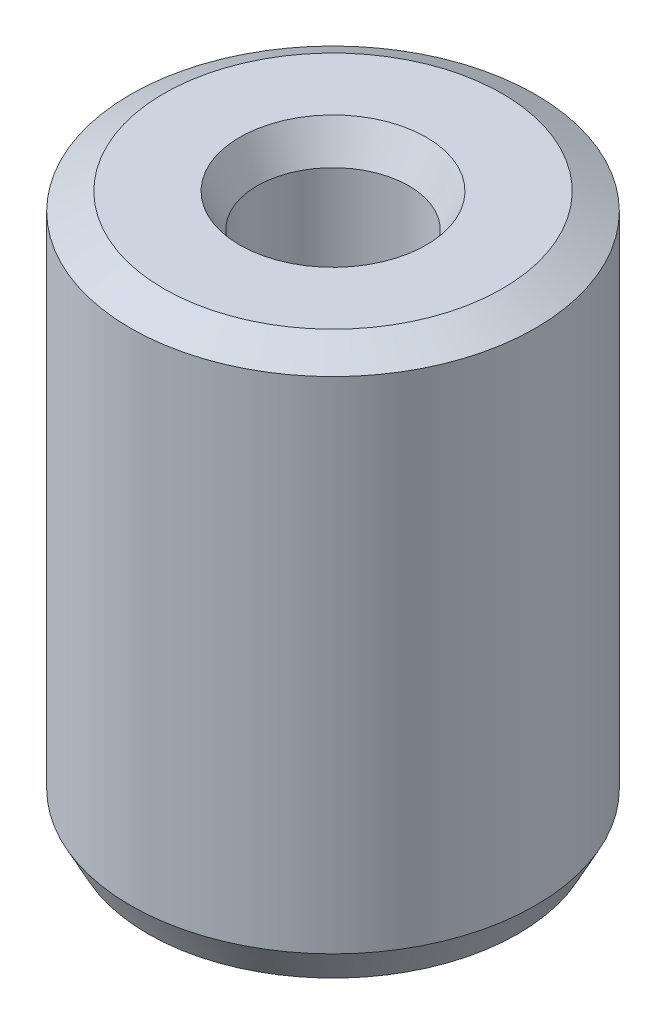
ISO-10303-21;
HEADER;
FILE_DESCRIPTION(('STEP AP214'),'2;1');
FILE_NAME('part.step','',(''),(''),'','','');
FILE_SCHEMA(('AUTOMOTIVE_DESIGN { 1 0 10303 214 1 1 1 1 }'));
ENDSEC;
DATA;
#1=APPLICATION_CONTEXT('core data for automotive mechanical design processes');
#2=APPLICATION_PROTOCOL_DEFINITION('international standard','automotive_design',2000,#1);
#3=PRODUCT_CONTEXT('',#1,'mechanical');
#4=PRODUCT('Part','Part','',(#3));
#5=PRODUCT_RELATED_PRODUCT_CATEGORY('part','',(#4));
#6=PRODUCT_DEFINITION_FORMATION('','',#4);
#7=PRODUCT_DEFINITION_CONTEXT('part definition',#1,'design');
#8=PRODUCT_DEFINITION('design','',#6,#7);
#9=PRODUCT_DEFINITION_SHAPE('','',#8);
#10=(LENGTH_UNIT() NAMED_UNIT(*) SI_UNIT(.MILLI.,.METRE.));
#11=(NAMED_UNIT(*) PLANE_ANGLE_UNIT() SI_UNIT($,.RADIAN.));
#12=(NAMED_UNIT(*) SI_UNIT($,.STERADIAN.) SOLID_ANGLE_UNIT());
#13=UNCERTAINTY_MEASURE_WITH_UNIT(LENGTH_MEASURE(1.E-05),#10,'distance_accuracy_value','');
#14=(GEOMETRIC_REPRESENTATION_CONTEXT(3) GLOBAL_UNCERTAINTY_ASSIGNED_CONTEXT((#13)) GLOBAL_UNIT_ASSIGNED_CONTEXT((#10,
#11,#12)) REPRESENTATION_CONTEXT('',''));
#15=CARTESIAN_POINT('',(0.,0.,0.));
#16=DIRECTION('',(0.,0.,1.));
#17=DIRECTION('',(1.,0.,0.));
#18=AXIS2_PLACEMENT_3D('',#15,#16,#17);
#19=CARTESIAN_POINT('',(0.,61.2046065079372,0.));
#20=DIRECTION('',(0.,-1.,0.));
#21=DIRECTION('',(0.,0.,-1.));
#22=AXIS2_PLACEMENT_3D('',#19,#20,#21);
#23=CYLINDRICAL_SURFACE('',#22,22.5);
#24=CARTESIAN_POINT('',(0.,3.70337874984975,0.));
#25=DIRECTION('',(0.,1.,0.));
#26=DIRECTION('',(0.,0.,1.));
#27=AXIS2_PLACEMENT_3D('',#24,#25,#26);
#28=CIRCLE('',#27,22.5);
#29=CARTESIAN_POINT('',(0.,3.70337874984975,22.5));
#30=VERTEX_POINT('',#29);
#31=EDGE_CURVE('E10',#30,#30,#28,.T.);
#32=ORIENTED_EDGE('',*,*,#31,.T.);
#33=EDGE_LOOP('',(#32));
#34=FACE_BOUND('',#33,.T.);
#35=CARTESIAN_POINT('',(0.,59.262396679795,0.));
#36=DIRECTION('',(0.,1.,0.));
#37=DIRECTION('',(0.,0.,1.));
#38=AXIS2_PLACEMENT_3D('',#35,#36,#37);
#39=CIRCLE('',#38,22.5);
#40=CARTESIAN_POINT('',(0.,59.262396679795,22.5));
#41=VERTEX_POINT('',#40);
#42=EDGE_CURVE('E50',#41,#41,#39,.F.);
#43=ORIENTED_EDGE('',*,*,#42,.T.);
#44=EDGE_LOOP('',(#43));
#45=FACE_BOUND('',#44,.T.);
#46=ADVANCED_FACE('F39',(#34,#45),#23,.T.);
#47=CARTESIAN_POINT('',(0.,61.2046065079372,0.));
#48=DIRECTION('',(0.,1.,0.));
#49=DIRECTION('',(0.,0.,1.));
#50=AXIS2_PLACEMENT_3D('',#47,#48,#49);
#51=PLANE('',#50);
#52=CARTESIAN_POINT('',(0.,61.2046065079372,0.));
#53=DIRECTION('',(0.,1.,0.));
#54=DIRECTION('',(0.,0.,1.));
#55=AXIS2_PLACEMENT_3D('',#52,#53,#54);
#56=CIRCLE('',#55,10.3734735527176);
#57=CARTESIAN_POINT('',(0.,61.2046065079372,10.3734735527176));
#58=VERTEX_POINT('',#57);
#59=EDGE_CURVE('E58',#58,#58,#56,.F.);
#60=ORIENTED_EDGE('',*,*,#59,.T.);
#61=EDGE_LOOP('',(#60));
#62=FACE_BOUND('',#61,.T.);
#63=CARTESIAN_POINT('',(0.,61.2046065079372,0.));
#64=DIRECTION('',(0.,1.,0.));
#65=DIRECTION('',(0.,0.,1.));
#66=AXIS2_PLACEMENT_3D('',#63,#64,#65);
#67=CIRCLE('',#66,18.7966212501502);
#68=CARTESIAN_POINT('',(0.,61.2046065079372,18.7966212501502));
#69=VERTEX_POINT('',#68);
#70=EDGE_CURVE('E61',#69,#69,#67,.T.);
#71=ORIENTED_EDGE('',*,*,#70,.T.);
#72=EDGE_LOOP('',(#71));
#73=FACE_BOUND('',#72,.T.);
#74=ADVANCED_FACE('F88',(#62,#73),#51,.T.);
#75=CARTESIAN_POINT('',(0.,0.,0.));
#76=DIRECTION('',(0.,1.,0.));
#77=DIRECTION('',(0.,0.,1.));
#78=AXIS2_PLACEMENT_3D('',#75,#76,#77);
#79=PLANE('',#78);
#80=CARTESIAN_POINT('',(0.,0.,0.));
#81=DIRECTION('',(0.,1.,0.));
#82=DIRECTION('',(0.,0.,1.));
#83=AXIS2_PLACEMENT_3D('',#80,#81,#82);
#84=CIRCLE('',#83,12.1346424744253);
#85=CARTESIAN_POINT('',(0.,0.,-12.1346424744253));
#86=VERTEX_POINT('',#85);
#87=EDGE_CURVE('E51',#86,#86,#84,.T.);
#88=ORIENTED_EDGE('',*,*,#87,.T.);
#89=EDGE_LOOP('',(#88));
#90=FACE_BOUND('',#89,.T.);
#91=CARTESIAN_POINT('',(0.,0.,0.));
#92=DIRECTION('',(0.,1.,0.));
#93=DIRECTION('',(0.,0.,1.));
#94=AXIS2_PLACEMENT_3D('',#91,#92,#93);
#95=CIRCLE('',#94,20.5577901718579);
#96=CARTESIAN_POINT('',(0.,0.,20.5577901718579));
#97=VERTEX_POINT('',#96);
#98=EDGE_CURVE('E54',#97,#97,#95,.F.);
#99=ORIENTED_EDGE('',*,*,#98,.T.);
#100=EDGE_LOOP('',(#99));
#101=FACE_BOUND('',#100,.T.);
#102=ADVANCED_FACE('F83',(#90,#101),#79,.F.);
#103=CARTESIAN_POINT('',(0.,61.2046065079372,0.));
#104=DIRECTION('',(0.,-1.,0.));
#105=DIRECTION('',(0.,0.,-1.));
#106=AXIS2_PLACEMENT_3D('',#103,#104,#105);
#107=CYLINDRICAL_SURFACE('',#106,8.43126372457545);
#108=CARTESIAN_POINT('',(0.,57.5012277580874,0.));
#109=DIRECTION('',(0.,1.,0.));
#110=DIRECTION('',(0.,0.,1.));
#111=AXIS2_PLACEMENT_3D('',#108,#109,#110);
#112=CIRCLE('',#111,8.43126372457545);
#113=CARTESIAN_POINT('',(0.,57.5012277580874,8.43126372457545));
#114=VERTEX_POINT('',#113);
#115=EDGE_CURVE('E67',#114,#114,#112,.T.);
#116=ORIENTED_EDGE('',*,*,#115,.T.);
#117=EDGE_LOOP('',(#116));
#118=FACE_BOUND('',#117,.T.);
#119=CARTESIAN_POINT('',(0.,1.94220982814217,0.));
#120=DIRECTION('',(0.,1.,0.));
#121=DIRECTION('',(0.,0.,1.));
#122=AXIS2_PLACEMENT_3D('',#119,#120,#121);
#123=CIRCLE('',#122,8.43126372457545);
#124=CARTESIAN_POINT('',(0.,1.94220982814217,-8.43126372457545));
#125=VERTEX_POINT('',#124);
#126=EDGE_CURVE('E69',#125,#125,#123,.F.);
#127=ORIENTED_EDGE('',*,*,#126,.T.);
#128=EDGE_LOOP('',(#127));
#129=FACE_BOUND('',#128,.T.);
#130=ADVANCED_FACE('F71',(#118,#129),#107,.F.);
#131=CARTESIAN_POINT('',(0.,57.5012277580874,0.));
#132=DIRECTION('',(0.,1.,0.));
#133=DIRECTION('',(0.,0.,1.));
#134=AXIS2_PLACEMENT_3D('',#131,#132,#133);
#135=CONICAL_SURFACE('',#134,8.43126372457545,0.483009991532542);
#136=ORIENTED_EDGE('',*,*,#59,.F.);
#137=EDGE_LOOP('',(#136));
#138=FACE_BOUND('',#137,.T.);
#139=ORIENTED_EDGE('',*,*,#115,.F.);
#140=EDGE_LOOP('',(#139));
#141=FACE_BOUND('',#140,.T.);
#142=ADVANCED_FACE('F77',(#138,#141),#135,.F.);
#143=CARTESIAN_POINT('',(0.,0.,0.));
#144=DIRECTION('',(0.,-1.,0.));
#145=DIRECTION('',(0.,0.,-1.));
#146=AXIS2_PLACEMENT_3D('',#143,#144,#145);
#147=CONICAL_SURFACE('',#146,12.1346424744253,1.08778633526236);
#148=CARTESIAN_POINT('',(0.,1.94220982814217,-8.43126372457545));
#149=CARTESIAN_POINT('',(0.,1.92197847576569,-8.46984058655305));
#150=CARTESIAN_POINT('',(0.,1.9017471233892,-8.50841744853065));
#151=CARTESIAN_POINT('',(0.,1.86128441863624,-8.58557117248585));
#152=CARTESIAN_POINT('',(0.,1.84105306625976,-8.62414803446346));
#153=CARTESIAN_POINT('',(0.,1.8005903615068,-8.70130175841866));
#154=CARTESIAN_POINT('',(0.,1.78035900913032,-8.73987862039626));
#155=CARTESIAN_POINT('',(0.,1.73989630437736,-8.81703234435147));
#156=CARTESIAN_POINT('',(0.,1.71966495200088,-8.85560920632907));
#157=CARTESIAN_POINT('',(0.,1.67920224724791,-8.93276293028427));
#158=CARTESIAN_POINT('',(0.,1.65897089487143,-8.97133979226188));
#159=CARTESIAN_POINT('',(0.,1.61850819011847,-9.04849351621708));
#160=CARTESIAN_POINT('',(0.,1.59827683774199,-9.08707037819468));
#161=CARTESIAN_POINT('',(0.,1.55781413298903,-9.16422410214989));
#162=CARTESIAN_POINT('',(0.,1.53758278061255,-9.20280096412749));
#163=CARTESIAN_POINT('',(0.,1.49712007585959,-9.27995468808269));
#164=CARTESIAN_POINT('',(0.,1.47688872348311,-9.3185315500603));
#165=CARTESIAN_POINT('',(0.,1.43642601873014,-9.3956852740155));
#166=CARTESIAN_POINT('',(0.,1.41619466635366,-9.4342621359931));
#167=CARTESIAN_POINT('',(0.,1.3757319616007,-9.51141585994831));
#168=CARTESIAN_POINT('',(0.,1.35550060922422,-9.54999272192591));
#169=CARTESIAN_POINT('',(0.,1.31503790447126,-9.62714644588111));
#170=CARTESIAN_POINT('',(0.,1.29480655209478,-9.66572330785871));
#171=CARTESIAN_POINT('',(0.,1.25434384734182,-9.74287703181392));
#172=CARTESIAN_POINT('',(0.,1.23411249496533,-9.78145389379152));
#173=CARTESIAN_POINT('',(0.,1.19364979021237,-9.85860761774673));
#174=CARTESIAN_POINT('',(0.,1.17341843783589,-9.89718447972433));
#175=CARTESIAN_POINT('',(0.,1.13295573308293,-9.97433820367953));
#176=CARTESIAN_POINT('',(0.,1.11272438070645,-10.0129150656571));
#177=CARTESIAN_POINT('',(0.,1.07226167595349,-10.0900687896123));
#178=CARTESIAN_POINT('',(0.,1.05203032357701,-10.1286456515899));
#179=CARTESIAN_POINT('',(0.,1.01156761882404,-10.2057993755451));
#180=CARTESIAN_POINT('',(0.,0.991336266447564,-10.2443762375227));
#181=CARTESIAN_POINT('',(0.,0.950873561694602,-10.3215299614779));
#182=CARTESIAN_POINT('',(0.,0.930642209318121,-10.3601068234556));
#183=CARTESIAN_POINT('',(0.,0.89017950456516,-10.4372605474108));
#184=CARTESIAN_POINT('',(0.,0.869948152188678,-10.4758374093884));
#185=CARTESIAN_POINT('',(0.,0.829485447435717,-10.5529911333436));
#186=CARTESIAN_POINT('',(0.,0.809254095059236,-10.5915679953212));
#187=CARTESIAN_POINT('',(0.,0.768791390306274,-10.6687217192764));
#188=CARTESIAN_POINT('',(0.,0.748560037929793,-10.707298581254));
#189=CARTESIAN_POINT('',(0.,0.708097333176831,-10.7844523052092));
#190=CARTESIAN_POINT('',(0.,0.687865980800351,-10.8230291671868));
#191=CARTESIAN_POINT('',(0.,0.647403276047389,-10.900182891142));
#192=CARTESIAN_POINT('',(0.,0.627171923670908,-10.9387597531196));
#193=CARTESIAN_POINT('',(0.,0.586709218917946,-11.0159134770748));
#194=CARTESIAN_POINT('',(0.,0.566477866541465,-11.0544903390524));
#195=CARTESIAN_POINT('',(0.,0.526015161788503,-11.1316440630076));
#196=CARTESIAN_POINT('',(0.,0.505783809412023,-11.1702209249852));
#197=CARTESIAN_POINT('',(0.,0.465321104659061,-11.2473746489404));
#198=CARTESIAN_POINT('',(0.,0.44508975228258,-11.285951510918));
#199=CARTESIAN_POINT('',(0.,0.404627047529618,-11.3631052348732));
#200=CARTESIAN_POINT('',(0.,0.384395695153137,-11.4016820968508));
#201=CARTESIAN_POINT('',(0.,0.343932990400175,-11.478835820806));
#202=CARTESIAN_POINT('',(0.,0.323701638023694,-11.5174126827836));
#203=CARTESIAN_POINT('',(0.,0.283238933270732,-11.5945664067388));
#204=CARTESIAN_POINT('',(0.,0.263007580894252,-11.6331432687164));
#205=CARTESIAN_POINT('',(0.,0.22254487614129,-11.7102969926716));
#206=CARTESIAN_POINT('',(0.,0.202313523764809,-11.7488738546492));
#207=CARTESIAN_POINT('',(0.,0.161850819011847,-11.8260275786044));
#208=CARTESIAN_POINT('',(0.,0.141619466635366,-11.864604440582));
#209=CARTESIAN_POINT('',(0.,0.101156761882405,-11.9417581645372));
#210=CARTESIAN_POINT('',(0.,0.0809254095059236,-11.9803350265148));
#211=CARTESIAN_POINT('',(0.,0.0404627047529615,-12.05748875047));
#212=CARTESIAN_POINT('',(0.,0.0202313523764805,-12.0960656124476));
#213=CARTESIAN_POINT('',(0.,0.,-12.1346424744253));
#214=B_SPLINE_CURVE_WITH_KNOTS('',3,(#148,#149,#150,#151,#152,#153,#154,#155,#156,#157,#158,
#159,#160,#161,#162,#163,#164,#165,#166,#167,#168,#169,#170,#171,#172,#173,#174,#175,#176,#177,
#178,#179,#180,#181,#182,#183,#184,#185,#186,#187,#188,#189,#190,#191,#192,#193,#194,#195,#196,
#197,#198,#199,#200,#201,#202,#203,#204,#205,#206,#207,#208,#209,#210,#211,#212,#213),
.UNSPECIFIED.,.F.,.F.,(4,2,2,2,2,2,2,2,2,2,2,2,2,2,2,2,2,2,2,2,2,2,2,2,2,2,2,2,2,2,2,2,4),(0.,
0.130680285778624,0.261360571557247,0.392040857335871,0.522721143114494,0.653401428893118,
0.784081714671743,0.914762000450365,1.04544228622899,1.17612257200761,1.30680285778624,
1.43748314356486,1.56816342934348,1.69884371512211,1.82952400090073,1.96020428667935,
2.09088457245798,2.2215648582366,2.35224514401522,2.48292542979385,2.61360571557247,
2.7442860013511,2.87496628712972,3.00564657290834,3.13632685868697,3.26700714446559,
3.39768743024422,3.52836771602284,3.65904800180146,3.78972828758009,3.92040857335871,
4.05108885913733,4.18176914491596),.UNSPECIFIED.);
#215=EDGE_CURVE('BSEAM73',#125,#86,#214,.T.);
#216=ORIENTED_EDGE('',*,*,#126,.F.);
#217=ORIENTED_EDGE('',*,*,#87,.F.);
#218=ORIENTED_EDGE('',*,*,#215,.T.);
#219=ORIENTED_EDGE('',*,*,#215,.F.);
#220=EDGE_LOOP('',(#216,#218,#217,#219));
#221=FACE_BOUND('',#220,.T.);
#222=ADVANCED_FACE('F73',(#221),#147,.F.);
#223=CARTESIAN_POINT('',(0.,3.70337874984975,0.));
#224=DIRECTION('',(0.,1.,0.));
#225=DIRECTION('',(0.,0.,1.));
#226=AXIS2_PLACEMENT_3D('',#223,#224,#225);
#227=CONICAL_SURFACE('',#226,22.5,0.483009991532541);
#228=ORIENTED_EDGE('',*,*,#98,.F.);
#229=EDGE_LOOP('',(#228));
#230=FACE_BOUND('',#229,.T.);
#231=ORIENTED_EDGE('',*,*,#31,.F.);
#232=EDGE_LOOP('',(#231));
#233=FACE_BOUND('',#232,.T.);
#234=ADVANCED_FACE('F76',(#230,#233),#227,.T.);
#235=CARTESIAN_POINT('',(0.,61.2046065079372,0.));
#236=DIRECTION('',(0.,-1.,0.));
#237=DIRECTION('',(0.,0.,-1.));
#238=AXIS2_PLACEMENT_3D('',#235,#236,#237);
#239=CONICAL_SURFACE('',#238,18.7966212501502,1.08778633526236);
#240=ORIENTED_EDGE('',*,*,#42,.F.);
#241=EDGE_LOOP('',(#240));
#242=FACE_BOUND('',#241,.T.);
#243=ORIENTED_EDGE('',*,*,#70,.F.);
#244=EDGE_LOOP('',(#243));
#245=FACE_BOUND('',#244,.T.);
#246=ADVANCED_FACE('F45',(#242,#245),#239,.T.);
#247=CLOSED_SHELL('',(#46,#74,#102,#130,#142,#222,#234,#246));
#248=MANIFOLD_SOLID_BREP('B2',#247);
#249=ADVANCED_BREP_SHAPE_REPRESENTATION('',(#18,#248),#14);
#250=SHAPE_DEFINITION_REPRESENTATION(#9,#249);
ENDSEC;
END-ISO-10303-21;
